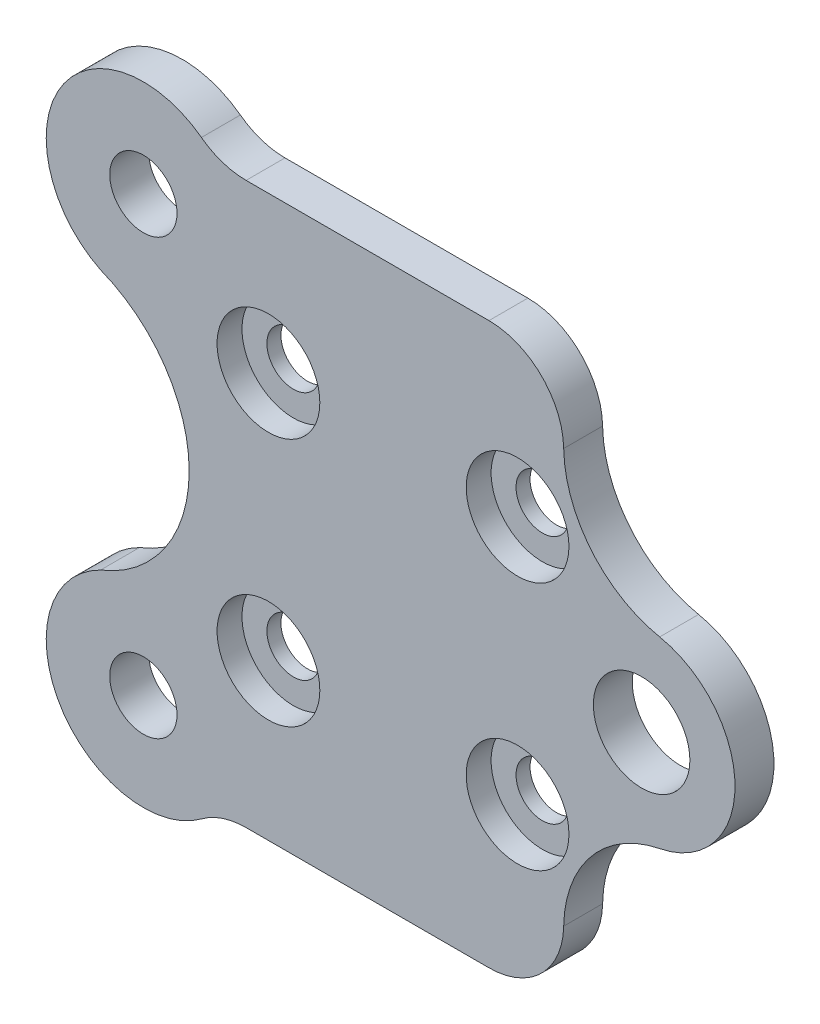
ISO-10303-21;
HEADER;
FILE_DESCRIPTION(('STEP AP214'),'2;1');
FILE_NAME('part.step','',(''),(''),'','','');
FILE_SCHEMA(('AUTOMOTIVE_DESIGN { 1 0 10303 214 1 1 1 1 }'));
ENDSEC;
DATA;
#1=APPLICATION_CONTEXT('core data for automotive mechanical design processes');
#2=APPLICATION_PROTOCOL_DEFINITION('international standard','automotive_design',2000,#1);
#3=PRODUCT_CONTEXT('',#1,'mechanical');
#4=PRODUCT('Part','Part','',(#3));
#5=PRODUCT_RELATED_PRODUCT_CATEGORY('part','',(#4));
#6=PRODUCT_DEFINITION_FORMATION('','',#4);
#7=PRODUCT_DEFINITION_CONTEXT('part definition',#1,'design');
#8=PRODUCT_DEFINITION('design','',#6,#7);
#9=PRODUCT_DEFINITION_SHAPE('','',#8);
#10=(LENGTH_UNIT() NAMED_UNIT(*) SI_UNIT(.MILLI.,.METRE.));
#11=(NAMED_UNIT(*) PLANE_ANGLE_UNIT() SI_UNIT($,.RADIAN.));
#12=(NAMED_UNIT(*) SI_UNIT($,.STERADIAN.) SOLID_ANGLE_UNIT());
#13=UNCERTAINTY_MEASURE_WITH_UNIT(LENGTH_MEASURE(1.E-05),#10,'distance_accuracy_value','');
#14=(GEOMETRIC_REPRESENTATION_CONTEXT(3) GLOBAL_UNCERTAINTY_ASSIGNED_CONTEXT((#13)) GLOBAL_UNIT_ASSIGNED_CONTEXT((#10,
#11,#12)) REPRESENTATION_CONTEXT('',''));
#15=CARTESIAN_POINT('',(0.,0.,0.));
#16=DIRECTION('',(0.,0.,1.));
#17=DIRECTION('',(1.,0.,0.));
#18=AXIS2_PLACEMENT_3D('',#15,#16,#17);
#19=CARTESIAN_POINT('',(82.0500548673,27.4305081809208,-3.125));
#20=DIRECTION('',(0.,0.,1.));
#21=DIRECTION('',(1.,0.,0.));
#22=AXIS2_PLACEMENT_3D('',#19,#20,#21);
#23=CYLINDRICAL_SURFACE('',#22,2.125);
#24=CARTESIAN_POINT('',(82.0500548673,27.4305081809208,-3.125));
#25=DIRECTION('',(0.,0.,1.));
#26=DIRECTION('',(1.,0.,0.));
#27=AXIS2_PLACEMENT_3D('',#24,#25,#26);
#28=CIRCLE('',#27,2.125);
#29=CARTESIAN_POINT('',(84.1750548673,27.4305081809208,-3.125));
#30=VERTEX_POINT('',#29);
#31=EDGE_CURVE('E501',#30,#30,#28,.T.);
#32=ORIENTED_EDGE('',*,*,#31,.F.);
#33=EDGE_LOOP('',(#32));
#34=FACE_BOUND('',#33,.T.);
#35=CARTESIAN_POINT('',(82.0500548673,27.4305081809208,-2.));
#36=DIRECTION('',(0.,0.,1.));
#37=DIRECTION('',(1.,0.,0.));
#38=AXIS2_PLACEMENT_3D('',#35,#36,#37);
#39=CIRCLE('',#38,2.125);
#40=CARTESIAN_POINT('',(84.1750548673,27.4305081809208,-2.));
#41=VERTEX_POINT('',#40);
#42=EDGE_CURVE('E414',#41,#41,#39,.F.);
#43=ORIENTED_EDGE('',*,*,#42,.F.);
#44=EDGE_LOOP('',(#43));
#45=FACE_BOUND('',#44,.T.);
#46=ADVANCED_FACE('F264',(#34,#45),#23,.F.);
#47=CARTESIAN_POINT('',(62.05010788,27.4305081809208,-3.125));
#48=DIRECTION('',(0.,0.,1.));
#49=DIRECTION('',(1.,0.,0.));
#50=AXIS2_PLACEMENT_3D('',#47,#48,#49);
#51=CYLINDRICAL_SURFACE('',#50,2.12500000000001);
#52=CARTESIAN_POINT('',(62.05010788,27.4305081809208,-3.125));
#53=DIRECTION('',(0.,0.,1.));
#54=DIRECTION('',(1.,0.,0.));
#55=AXIS2_PLACEMENT_3D('',#52,#53,#54);
#56=CIRCLE('',#55,2.12500000000001);
#57=CARTESIAN_POINT('',(64.17510788,27.4305081809208,-3.125));
#58=VERTEX_POINT('',#57);
#59=EDGE_CURVE('E496',#58,#58,#56,.T.);
#60=ORIENTED_EDGE('',*,*,#59,.F.);
#61=EDGE_LOOP('',(#60));
#62=FACE_BOUND('',#61,.T.);
#63=CARTESIAN_POINT('',(62.05010788,27.4305081809208,-2.));
#64=DIRECTION('',(0.,0.,1.));
#65=DIRECTION('',(1.,0.,0.));
#66=AXIS2_PLACEMENT_3D('',#63,#64,#65);
#67=CIRCLE('',#66,2.12500000000001);
#68=CARTESIAN_POINT('',(64.17510788,27.4305081809208,-2.));
#69=VERTEX_POINT('',#68);
#70=EDGE_CURVE('E529',#69,#69,#67,.T.);
#71=ORIENTED_EDGE('',*,*,#70,.T.);
#72=EDGE_LOOP('',(#71));
#73=FACE_BOUND('',#72,.T.);
#74=ADVANCED_FACE('F573',(#62,#73),#51,.F.);
#75=CARTESIAN_POINT('',(62.05010788,7.43050818092083,-3.125));
#76=DIRECTION('',(0.,0.,1.));
#77=DIRECTION('',(1.,0.,0.));
#78=AXIS2_PLACEMENT_3D('',#75,#76,#77);
#79=CYLINDRICAL_SURFACE('',#78,2.125);
#80=CARTESIAN_POINT('',(62.05010788,7.43050818092083,-3.125));
#81=DIRECTION('',(0.,0.,1.));
#82=DIRECTION('',(1.,0.,0.));
#83=AXIS2_PLACEMENT_3D('',#80,#81,#82);
#84=CIRCLE('',#83,2.125);
#85=CARTESIAN_POINT('',(64.17510788,7.43050818092083,-3.125));
#86=VERTEX_POINT('',#85);
#87=EDGE_CURVE('E507',#86,#86,#84,.T.);
#88=ORIENTED_EDGE('',*,*,#87,.F.);
#89=EDGE_LOOP('',(#88));
#90=FACE_BOUND('',#89,.T.);
#91=CARTESIAN_POINT('',(62.05010788,7.43050818092083,-2.));
#92=DIRECTION('',(0.,0.,1.));
#93=DIRECTION('',(1.,0.,0.));
#94=AXIS2_PLACEMENT_3D('',#91,#92,#93);
#95=CIRCLE('',#94,2.125);
#96=CARTESIAN_POINT('',(64.17510788,7.43050818092083,-2.));
#97=VERTEX_POINT('',#96);
#98=EDGE_CURVE('E520',#97,#97,#95,.T.);
#99=ORIENTED_EDGE('',*,*,#98,.T.);
#100=EDGE_LOOP('',(#99));
#101=FACE_BOUND('',#100,.T.);
#102=ADVANCED_FACE('F579',(#90,#101),#79,.F.);
#103=CARTESIAN_POINT('',(82.0500548673,7.43050818092083,-3.125));
#104=DIRECTION('',(0.,0.,1.));
#105=DIRECTION('',(1.,0.,0.));
#106=AXIS2_PLACEMENT_3D('',#103,#104,#105);
#107=CYLINDRICAL_SURFACE('',#106,2.125);
#108=CARTESIAN_POINT('',(82.0500548673,7.43050818092083,-3.125));
#109=DIRECTION('',(0.,0.,1.));
#110=DIRECTION('',(1.,0.,0.));
#111=AXIS2_PLACEMENT_3D('',#108,#109,#110);
#112=CIRCLE('',#111,2.125);
#113=CARTESIAN_POINT('',(84.1750548673,7.43050818092083,-3.125));
#114=VERTEX_POINT('',#113);
#115=EDGE_CURVE('E504',#114,#114,#112,.T.);
#116=ORIENTED_EDGE('',*,*,#115,.F.);
#117=EDGE_LOOP('',(#116));
#118=FACE_BOUND('',#117,.T.);
#119=CARTESIAN_POINT('',(82.0500548673,7.43050818092083,-2.));
#120=DIRECTION('',(0.,0.,1.));
#121=DIRECTION('',(1.,0.,0.));
#122=AXIS2_PLACEMENT_3D('',#119,#120,#121);
#123=CIRCLE('',#122,2.125);
#124=CARTESIAN_POINT('',(84.1750548673,7.43050818092083,-2.));
#125=VERTEX_POINT('',#124);
#126=EDGE_CURVE('E514',#125,#125,#123,.T.);
#127=ORIENTED_EDGE('',*,*,#126,.T.);
#128=EDGE_LOOP('',(#127));
#129=FACE_BOUND('',#128,.T.);
#130=ADVANCED_FACE('F585',(#118,#129),#107,.F.);
#131=CARTESIAN_POINT('',(52.0082075214231,-0.00478709079274138,-3.125));
#132=DIRECTION('',(0.,0.,1.));
#133=DIRECTION('',(1.,0.,0.));
#134=AXIS2_PLACEMENT_3D('',#131,#132,#133);
#135=CYLINDRICAL_SURFACE('',#134,7.80000000000975);
#136=CARTESIAN_POINT('',(52.0082075214231,-0.00478709079274138,-3.125));
#137=DIRECTION('',(0.,0.,1.));
#138=DIRECTION('',(1.,0.,0.));
#139=AXIS2_PLACEMENT_3D('',#136,#137,#138);
#140=CIRCLE('',#139,7.80000000000975);
#141=CARTESIAN_POINT('',(48.5735901579423,6.99831247772894,-3.125));
#142=VERTEX_POINT('',#141);
#143=CARTESIAN_POINT('',(56.6695313692701,-6.25875063287107,-3.125));
#144=VERTEX_POINT('',#143);
#145=EDGE_CURVE('E406',#142,#144,#140,.T.);
#146=ORIENTED_EDGE('',*,*,#145,.T.);
#147=DIRECTION('',(0.,0.,1.));
#148=VECTOR('',#147,1.);
#149=CARTESIAN_POINT('',(56.6695313692701,-6.25875063287107,-3.125));
#150=LINE('',#149,#148);
#151=CARTESIAN_POINT('',(56.6695313692701,-6.25875063287107,0.));
#152=VERTEX_POINT('',#151);
#153=EDGE_CURVE('E442',#144,#152,#150,.T.);
#154=ORIENTED_EDGE('',*,*,#153,.T.);
#155=CARTESIAN_POINT('',(52.0082075214231,-0.00478709079274138,0.));
#156=DIRECTION('',(0.,0.,1.));
#157=DIRECTION('',(1.,0.,0.));
#158=AXIS2_PLACEMENT_3D('',#155,#156,#157);
#159=CIRCLE('',#158,7.80000000000975);
#160=CARTESIAN_POINT('',(48.5735901579423,6.99831247772894,0.));
#161=VERTEX_POINT('',#160);
#162=EDGE_CURVE('E389',#161,#152,#159,.T.);
#163=ORIENTED_EDGE('',*,*,#162,.F.);
#164=DIRECTION('',(0.,0.,1.));
#165=VECTOR('',#164,1.);
#166=CARTESIAN_POINT('',(48.5735901579423,6.99831247772894,-3.125));
#167=LINE('',#166,#165);
#168=EDGE_CURVE('E407',#142,#161,#167,.T.);
#169=ORIENTED_EDGE('',*,*,#168,.F.);
#170=EDGE_LOOP('',(#146,#154,#163,#169));
#171=FACE_BOUND('',#170,.T.);
#172=ADVANCED_FACE('F474',(#171),#135,.T.);
#173=CARTESIAN_POINT('',(44.4800195239708,17.4305081809208,-3.125));
#174=DIRECTION('',(0.,0.,1.));
#175=DIRECTION('',(1.,0.,0.));
#176=AXIS2_PLACEMENT_3D('',#173,#174,#175);
#177=CYLINDRICAL_SURFACE('',#176,11.2066064321457);
#178=CARTESIAN_POINT('',(44.4800195239708,17.4305081809208,0.));
#179=DIRECTION('',(0.,0.,1.));
#180=DIRECTION('',(1.,0.,0.));
#181=AXIS2_PLACEMENT_3D('',#178,#179,#180);
#182=CIRCLE('',#181,11.2066064321457);
#183=CARTESIAN_POINT('',(48.5735901579423,27.8627038841127,0.));
#184=VERTEX_POINT('',#183);
#185=EDGE_CURVE('E404',#161,#184,#182,.T.);
#186=ORIENTED_EDGE('',*,*,#185,.T.);
#187=DIRECTION('',(0.,0.,1.));
#188=VECTOR('',#187,1.);
#189=CARTESIAN_POINT('',(48.5735901579423,27.8627038841127,-3.125));
#190=LINE('',#189,#188);
#191=CARTESIAN_POINT('',(48.5735901579423,27.8627038841127,-3.125));
#192=VERTEX_POINT('',#191);
#193=EDGE_CURVE('E410',#192,#184,#190,.T.);
#194=ORIENTED_EDGE('',*,*,#193,.F.);
#195=CARTESIAN_POINT('',(44.4800195239708,17.4305081809208,-3.125));
#196=DIRECTION('',(0.,0.,1.));
#197=DIRECTION('',(1.,0.,0.));
#198=AXIS2_PLACEMENT_3D('',#195,#196,#197);
#199=CIRCLE('',#198,11.2066064321457);
#200=EDGE_CURVE('E363',#142,#192,#199,.T.);
#201=ORIENTED_EDGE('',*,*,#200,.F.);
#202=ORIENTED_EDGE('',*,*,#168,.T.);
#203=EDGE_LOOP('',(#186,#194,#201,#202));
#204=FACE_BOUND('',#203,.T.);
#205=ADVANCED_FACE('F469',(#204),#177,.F.);
#206=CARTESIAN_POINT('',(52.0082075214231,34.8658034526344,-3.125));
#207=DIRECTION('',(0.,0.,1.));
#208=DIRECTION('',(1.,0.,0.));
#209=AXIS2_PLACEMENT_3D('',#206,#207,#208);
#210=CYLINDRICAL_SURFACE('',#209,7.80000000000975);
#211=CARTESIAN_POINT('',(52.0082075214231,34.8658034526344,0.));
#212=DIRECTION('',(0.,0.,-1.));
#213=DIRECTION('',(-1.,0.,0.));
#214=AXIS2_PLACEMENT_3D('',#211,#212,#213);
#215=CIRCLE('',#214,7.80000000000975);
#216=CARTESIAN_POINT('',(56.6695313692701,41.1197669947127,0.));
#217=VERTEX_POINT('',#216);
#218=EDGE_CURVE('E401',#184,#217,#215,.T.);
#219=ORIENTED_EDGE('',*,*,#218,.T.);
#220=DIRECTION('',(0.,0.,1.));
#221=VECTOR('',#220,1.);
#222=CARTESIAN_POINT('',(56.6695313692701,41.1197669947127,-3.125));
#223=LINE('',#222,#221);
#224=CARTESIAN_POINT('',(56.6695313692701,41.1197669947127,-3.125));
#225=VERTEX_POINT('',#224);
#226=EDGE_CURVE('E440',#217,#225,#223,.F.);
#227=ORIENTED_EDGE('',*,*,#226,.T.);
#228=CARTESIAN_POINT('',(52.0082075214231,34.8658034526344,-3.125));
#229=DIRECTION('',(0.,0.,-1.));
#230=DIRECTION('',(-1.,0.,0.));
#231=AXIS2_PLACEMENT_3D('',#228,#229,#230);
#232=CIRCLE('',#231,7.80000000000975);
#233=EDGE_CURVE('E385',#192,#225,#232,.T.);
#234=ORIENTED_EDGE('',*,*,#233,.F.);
#235=ORIENTED_EDGE('',*,*,#193,.T.);
#236=EDGE_LOOP('',(#219,#227,#234,#235));
#237=FACE_BOUND('',#236,.T.);
#238=ADVANCED_FACE('F465',(#237),#210,.T.);
#239=CARTESIAN_POINT('',(57.940219491693,39.9305081809208,-3.125));
#240=DIRECTION('',(0.,-1.,0.));
#241=DIRECTION('',(0.,0.,-1.));
#242=AXIS2_PLACEMENT_3D('',#239,#240,#241);
#243=PLANE('',#242);
#244=DIRECTION('',(1.,0.,0.));
#245=VECTOR('',#244,1.);
#246=CARTESIAN_POINT('',(57.940219491693,39.9305081809208,-3.125));
#247=LINE('',#246,#245);
#248=CARTESIAN_POINT('',(60.2551650983787,39.9305081809208,-3.125));
#249=VERTEX_POINT('',#248);
#250=CARTESIAN_POINT('',(79.7529034768474,39.9305081809208,-3.125));
#251=VERTEX_POINT('',#250);
#252=EDGE_CURVE('E380',#249,#251,#247,.T.);
#253=ORIENTED_EDGE('',*,*,#252,.F.);
#254=DIRECTION('',(0.,0.,-1.));
#255=VECTOR('',#254,1.);
#256=CARTESIAN_POINT('',(60.2551650983787,39.9305081809208,0.));
#257=LINE('',#256,#255);
#258=CARTESIAN_POINT('',(60.2551650983787,39.9305081809208,0.));
#259=VERTEX_POINT('',#258);
#260=EDGE_CURVE('E437',#249,#259,#257,.F.);
#261=ORIENTED_EDGE('',*,*,#260,.T.);
#262=DIRECTION('',(1.,0.,0.));
#263=VECTOR('',#262,1.);
#264=CARTESIAN_POINT('',(57.940219491693,39.9305081809208,0.));
#265=LINE('',#264,#263);
#266=CARTESIAN_POINT('',(79.7529034768474,39.9305081809208,0.));
#267=VERTEX_POINT('',#266);
#268=EDGE_CURVE('E399',#259,#267,#265,.T.);
#269=ORIENTED_EDGE('',*,*,#268,.T.);
#270=DIRECTION('',(0.,0.,1.));
#271=VECTOR('',#270,1.);
#272=CARTESIAN_POINT('',(79.7529034768474,39.9305081809208,-3.125));
#273=LINE('',#272,#271);
#274=EDGE_CURVE('E434',#267,#251,#273,.F.);
#275=ORIENTED_EDGE('',*,*,#274,.T.);
#276=EDGE_LOOP('',(#253,#261,#269,#275));
#277=FACE_BOUND('',#276,.T.);
#278=ADVANCED_FACE('F456',(#277),#243,.F.);
#279=CARTESIAN_POINT('',(95.3555620860846,34.2048076301968,-3.125));
#280=DIRECTION('',(0.,0.,1.));
#281=DIRECTION('',(1.,0.,0.));
#282=AXIS2_PLACEMENT_3D('',#279,#280,#281);
#283=CYLINDRICAL_SURFACE('',#282,9.60506955653446);
#284=CARTESIAN_POINT('',(95.3555620860846,34.2048076301968,-3.125));
#285=DIRECTION('',(0.,0.,1.));
#286=DIRECTION('',(1.,0.,0.));
#287=AXIS2_PLACEMENT_3D('',#284,#285,#286);
#288=CIRCLE('',#287,9.60506955653446);
#289=CARTESIAN_POINT('',(85.7519764906695,34.0359736958097,-3.125));
#290=VERTEX_POINT('',#289);
#291=CARTESIAN_POINT('',(93.4574363423077,24.7891568376772,-3.125));
#292=VERTEX_POINT('',#291);
#293=EDGE_CURVE('E377',#290,#292,#288,.T.);
#294=ORIENTED_EDGE('',*,*,#293,.F.);
#295=DIRECTION('',(0.,0.,1.));
#296=VECTOR('',#295,1.);
#297=CARTESIAN_POINT('',(85.7519764906695,34.0359736958097,-3.125));
#298=LINE('',#297,#296);
#299=CARTESIAN_POINT('',(85.7519764906695,34.0359736958097,0.));
#300=VERTEX_POINT('',#299);
#301=EDGE_CURVE('E431',#290,#300,#298,.T.);
#302=ORIENTED_EDGE('',*,*,#301,.T.);
#303=CARTESIAN_POINT('',(95.3555620860846,34.2048076301968,0.));
#304=DIRECTION('',(0.,0.,1.));
#305=DIRECTION('',(1.,0.,0.));
#306=AXIS2_PLACEMENT_3D('',#303,#304,#305);
#307=CIRCLE('',#306,9.60506955653446);
#308=CARTESIAN_POINT('',(93.4574363423077,24.7891568376772,0.));
#309=VERTEX_POINT('',#308);
#310=EDGE_CURVE('E397',#300,#309,#307,.T.);
#311=ORIENTED_EDGE('',*,*,#310,.T.);
#312=DIRECTION('',(0.,0.,1.));
#313=VECTOR('',#312,1.);
#314=CARTESIAN_POINT('',(93.4574363423077,24.7891568376772,-3.125));
#315=LINE('',#314,#313);
#316=EDGE_CURVE('E362',#292,#309,#315,.T.);
#317=ORIENTED_EDGE('',*,*,#316,.F.);
#318=EDGE_LOOP('',(#294,#302,#311,#317));
#319=FACE_BOUND('',#318,.T.);
#320=ADVANCED_FACE('F619',(#319),#283,.F.);
#321=CARTESIAN_POINT('',(92.0081986301231,17.4305081809208,-3.125));
#322=DIRECTION('',(0.,0.,1.));
#323=DIRECTION('',(1.,0.,0.));
#324=AXIS2_PLACEMENT_3D('',#321,#322,#323);
#325=CYLINDRICAL_SURFACE('',#324,7.49999999999999);
#326=CARTESIAN_POINT('',(92.0081986301231,17.4305081809208,0.));
#327=DIRECTION('',(0.,0.,1.));
#328=DIRECTION('',(1.,0.,0.));
#329=AXIS2_PLACEMENT_3D('',#326,#327,#328);
#330=CIRCLE('',#329,7.49999999999999);
#331=CARTESIAN_POINT('',(93.4574363423077,10.0718595241645,0.));
#332=VERTEX_POINT('',#331);
#333=EDGE_CURVE('E358',#332,#309,#330,.T.);
#334=ORIENTED_EDGE('',*,*,#333,.F.);
#335=DIRECTION('',(0.,0.,1.));
#336=VECTOR('',#335,1.);
#337=CARTESIAN_POINT('',(93.4574363423077,10.0718595241645,-3.125));
#338=LINE('',#337,#336);
#339=CARTESIAN_POINT('',(93.4574363423077,10.0718595241645,-3.125));
#340=VERTEX_POINT('',#339);
#341=EDGE_CURVE('E351',#340,#332,#338,.T.);
#342=ORIENTED_EDGE('',*,*,#341,.F.);
#343=CARTESIAN_POINT('',(92.0081986301231,17.4305081809208,-3.125));
#344=DIRECTION('',(0.,0.,1.));
#345=DIRECTION('',(1.,0.,0.));
#346=AXIS2_PLACEMENT_3D('',#343,#344,#345);
#347=CIRCLE('',#346,7.49999999999999);
#348=EDGE_CURVE('E356',#340,#292,#347,.T.);
#349=ORIENTED_EDGE('',*,*,#348,.T.);
#350=ORIENTED_EDGE('',*,*,#316,.T.);
#351=EDGE_LOOP('',(#334,#342,#349,#350));
#352=FACE_BOUND('',#351,.T.);
#353=ADVANCED_FACE('F353',(#352),#325,.T.);
#354=CARTESIAN_POINT('',(95.3555620860846,0.656208731644823,-3.125));
#355=DIRECTION('',(0.,0.,1.));
#356=DIRECTION('',(1.,0.,0.));
#357=AXIS2_PLACEMENT_3D('',#354,#355,#356);
#358=CYLINDRICAL_SURFACE('',#357,9.60506955653445);
#359=CARTESIAN_POINT('',(95.3555620860846,0.656208731644823,0.));
#360=DIRECTION('',(0.,0.,1.));
#361=DIRECTION('',(1.,0.,0.));
#362=AXIS2_PLACEMENT_3D('',#359,#360,#361);
#363=CIRCLE('',#362,9.60506955653445);
#364=CARTESIAN_POINT('',(85.7519764906695,0.825042666032002,0.));
#365=VERTEX_POINT('',#364);
#366=EDGE_CURVE('E394',#332,#365,#363,.T.);
#367=ORIENTED_EDGE('',*,*,#366,.T.);
#368=DIRECTION('',(0.,0.,1.));
#369=VECTOR('',#368,1.);
#370=CARTESIAN_POINT('',(85.7519764906695,0.825042666032002,-3.125));
#371=LINE('',#370,#369);
#372=CARTESIAN_POINT('',(85.7519764906695,0.825042666032002,-3.125));
#373=VERTEX_POINT('',#372);
#374=EDGE_CURVE('E369',#365,#373,#371,.F.);
#375=ORIENTED_EDGE('',*,*,#374,.T.);
#376=CARTESIAN_POINT('',(95.3555620860846,0.656208731644823,-3.125));
#377=DIRECTION('',(0.,0.,1.));
#378=DIRECTION('',(1.,0.,0.));
#379=AXIS2_PLACEMENT_3D('',#376,#377,#378);
#380=CIRCLE('',#379,9.60506955653445);
#381=EDGE_CURVE('E366',#340,#373,#380,.T.);
#382=ORIENTED_EDGE('',*,*,#381,.F.);
#383=ORIENTED_EDGE('',*,*,#341,.T.);
#384=EDGE_LOOP('',(#367,#375,#382,#383));
#385=FACE_BOUND('',#384,.T.);
#386=ADVANCED_FACE('F367',(#385),#358,.F.);
#387=CARTESIAN_POINT('',(57.940219491693,-5.06949181907916,-3.125));
#388=DIRECTION('',(0.,-1.,0.));
#389=DIRECTION('',(1.,0.,0.));
#390=AXIS2_PLACEMENT_3D('',#387,#388,#389);
#391=PLANE('',#390);
#392=DIRECTION('',(1.,0.,0.));
#393=VECTOR('',#392,1.);
#394=CARTESIAN_POINT('',(57.940219491693,-5.06949181907916,0.));
#395=LINE('',#394,#393);
#396=CARTESIAN_POINT('',(60.2551650983787,-5.06949181907916,0.));
#397=VERTEX_POINT('',#396);
#398=CARTESIAN_POINT('',(79.7529034768474,-5.06949181907915,0.));
#399=VERTEX_POINT('',#398);
#400=EDGE_CURVE('E391',#397,#399,#395,.T.);
#401=ORIENTED_EDGE('',*,*,#400,.F.);
#402=DIRECTION('',(0.,0.,-1.));
#403=VECTOR('',#402,1.);
#404=CARTESIAN_POINT('',(60.2551650983787,-5.06949181907916,-3.125));
#405=LINE('',#404,#403);
#406=CARTESIAN_POINT('',(60.2551650983787,-5.06949181907916,-3.125));
#407=VERTEX_POINT('',#406);
#408=EDGE_CURVE('E285',#397,#407,#405,.T.);
#409=ORIENTED_EDGE('',*,*,#408,.T.);
#410=DIRECTION('',(1.,0.,0.));
#411=VECTOR('',#410,1.);
#412=CARTESIAN_POINT('',(57.940219491693,-5.06949181907916,-3.125));
#413=LINE('',#412,#411);
#414=CARTESIAN_POINT('',(79.7529034768474,-5.06949181907915,-3.125));
#415=VERTEX_POINT('',#414);
#416=EDGE_CURVE('E373',#407,#415,#413,.T.);
#417=ORIENTED_EDGE('',*,*,#416,.T.);
#418=DIRECTION('',(0.,0.,-1.));
#419=VECTOR('',#418,1.);
#420=CARTESIAN_POINT('',(79.7529034768474,-5.06949181907915,0.));
#421=LINE('',#420,#419);
#422=EDGE_CURVE('E409',#415,#399,#421,.F.);
#423=ORIENTED_EDGE('',*,*,#422,.T.);
#424=EDGE_LOOP('',(#401,#409,#417,#423));
#425=FACE_BOUND('',#424,.T.);
#426=ADVANCED_FACE('F602',(#425),#391,.T.);
#427=CARTESIAN_POINT('',(52.0082075214231,-0.00478709079274138,-3.125));
#428=DIRECTION('',(0.,0.,1.));
#429=DIRECTION('',(1.,0.,0.));
#430=AXIS2_PLACEMENT_3D('',#427,#428,#429);
#431=PLANE('',#430);
#432=ORIENTED_EDGE('',*,*,#87,.T.);
#433=EDGE_LOOP('',(#432));
#434=FACE_BOUND('',#433,.T.);
#435=ORIENTED_EDGE('',*,*,#115,.T.);
#436=EDGE_LOOP('',(#435));
#437=FACE_BOUND('',#436,.T.);
#438=ORIENTED_EDGE('',*,*,#31,.T.);
#439=EDGE_LOOP('',(#438));
#440=FACE_BOUND('',#439,.T.);
#441=ORIENTED_EDGE('',*,*,#59,.T.);
#442=EDGE_LOOP('',(#441));
#443=FACE_BOUND('',#442,.T.);
#444=CARTESIAN_POINT('',(92.0081986301231,17.4305081809208,-3.125));
#445=DIRECTION('',(0.,0.,1.));
#446=DIRECTION('',(1.,0.,0.));
#447=AXIS2_PLACEMENT_3D('',#444,#445,#446);
#448=CIRCLE('',#447,3.875);
#449=CARTESIAN_POINT('',(95.8831986301231,17.4305081809208,-3.125));
#450=VERTEX_POINT('',#449);
#451=EDGE_CURVE('E490',#450,#450,#448,.T.);
#452=ORIENTED_EDGE('',*,*,#451,.T.);
#453=EDGE_LOOP('',(#452));
#454=FACE_BOUND('',#453,.T.);
#455=CARTESIAN_POINT('',(52.0082075214231,-0.00478709079274138,-3.125));
#456=DIRECTION('',(0.,0.,1.));
#457=DIRECTION('',(1.,0.,0.));
#458=AXIS2_PLACEMENT_3D('',#455,#456,#457);
#459=CIRCLE('',#458,2.7);
#460=CARTESIAN_POINT('',(54.7082075214231,-0.00478709079274138,-3.125));
#461=VERTEX_POINT('',#460);
#462=EDGE_CURVE('E484',#461,#461,#459,.T.);
#463=ORIENTED_EDGE('',*,*,#462,.T.);
#464=EDGE_LOOP('',(#463));
#465=FACE_BOUND('',#464,.T.);
#466=CARTESIAN_POINT('',(52.0082075214231,34.8658034526344,-3.125));
#467=DIRECTION('',(0.,0.,1.));
#468=DIRECTION('',(1.,0.,0.));
#469=AXIS2_PLACEMENT_3D('',#466,#467,#468);
#470=CIRCLE('',#469,2.70000000000001);
#471=CARTESIAN_POINT('',(54.7082075214231,34.8658034526344,-3.125));
#472=VERTEX_POINT('',#471);
#473=EDGE_CURVE('E392',#472,#472,#470,.T.);
#474=ORIENTED_EDGE('',*,*,#473,.T.);
#475=EDGE_LOOP('',(#474));
#476=FACE_BOUND('',#475,.T.);
#477=ORIENTED_EDGE('',*,*,#381,.T.);
#478=CARTESIAN_POINT('',(79.7529034768474,0.930508180920847,-3.125));
#479=DIRECTION('',(0.,0.,1.));
#480=DIRECTION('',(1.,0.,0.));
#481=AXIS2_PLACEMENT_3D('',#478,#479,#480);
#482=CIRCLE('',#481,6.);
#483=EDGE_CURVE('E429',#373,#415,#482,.F.);
#484=ORIENTED_EDGE('',*,*,#483,.T.);
#485=ORIENTED_EDGE('',*,*,#416,.F.);
#486=CARTESIAN_POINT('',(60.2551650983787,-11.0694918190792,-3.125));
#487=DIRECTION('',(0.,0.,1.));
#488=DIRECTION('',(1.,0.,0.));
#489=AXIS2_PLACEMENT_3D('',#486,#487,#488);
#490=CIRCLE('',#489,6.);
#491=EDGE_CURVE('E12',#407,#144,#490,.T.);
#492=ORIENTED_EDGE('',*,*,#491,.T.);
#493=ORIENTED_EDGE('',*,*,#145,.F.);
#494=ORIENTED_EDGE('',*,*,#200,.T.);
#495=ORIENTED_EDGE('',*,*,#233,.T.);
#496=CARTESIAN_POINT('',(60.2551650983787,45.9305081809208,-3.125));
#497=DIRECTION('',(0.,0.,1.));
#498=DIRECTION('',(1.,0.,0.));
#499=AXIS2_PLACEMENT_3D('',#496,#497,#498);
#500=CIRCLE('',#499,6.);
#501=EDGE_CURVE('E448',#225,#249,#500,.T.);
#502=ORIENTED_EDGE('',*,*,#501,.T.);
#503=ORIENTED_EDGE('',*,*,#252,.T.);
#504=CARTESIAN_POINT('',(79.7529034768474,33.9305081809208,-3.125));
#505=DIRECTION('',(0.,0.,1.));
#506=DIRECTION('',(1.,0.,0.));
#507=AXIS2_PLACEMENT_3D('',#504,#505,#506);
#508=CIRCLE('',#507,6.);
#509=EDGE_CURVE('E427',#251,#290,#508,.F.);
#510=ORIENTED_EDGE('',*,*,#509,.T.);
#511=ORIENTED_EDGE('',*,*,#293,.T.);
#512=ORIENTED_EDGE('',*,*,#348,.F.);
#513=EDGE_LOOP('',(#477,#484,#485,#492,#493,#494,#495,#502,#503,#510,#511,#512));
#514=FACE_BOUND('',#513,.T.);
#515=ADVANCED_FACE('F375',(#434,#437,#440,#443,#454,#465,#476,#514),#431,.F.);
#516=CARTESIAN_POINT('',(52.0082075214231,-0.00478709079274138,0.));
#517=DIRECTION('',(0.,0.,1.));
#518=DIRECTION('',(1.,0.,0.));
#519=AXIS2_PLACEMENT_3D('',#516,#517,#518);
#520=PLANE('',#519);
#521=CARTESIAN_POINT('',(82.0500548673,27.4305081809208,0.));
#522=DIRECTION('',(0.,0.,1.));
#523=DIRECTION('',(1.,0.,0.));
#524=AXIS2_PLACEMENT_3D('',#521,#522,#523);
#525=CIRCLE('',#524,4.125);
#526=CARTESIAN_POINT('',(86.1750548673,27.4305081809208,0.));
#527=VERTEX_POINT('',#526);
#528=EDGE_CURVE('E418',#527,#527,#525,.T.);
#529=ORIENTED_EDGE('',*,*,#528,.F.);
#530=EDGE_LOOP('',(#529));
#531=FACE_BOUND('',#530,.T.);
#532=CARTESIAN_POINT('',(62.05010788,27.4305081809208,0.));
#533=DIRECTION('',(0.,0.,1.));
#534=DIRECTION('',(1.,0.,0.));
#535=AXIS2_PLACEMENT_3D('',#532,#533,#534);
#536=CIRCLE('',#535,4.12500000000001);
#537=CARTESIAN_POINT('',(66.17510788,27.4305081809208,0.));
#538=VERTEX_POINT('',#537);
#539=EDGE_CURVE('E526',#538,#538,#536,.T.);
#540=ORIENTED_EDGE('',*,*,#539,.F.);
#541=EDGE_LOOP('',(#540));
#542=FACE_BOUND('',#541,.T.);
#543=CARTESIAN_POINT('',(62.05010788,7.43050818092083,0.));
#544=DIRECTION('',(0.,0.,1.));
#545=DIRECTION('',(1.,0.,0.));
#546=AXIS2_PLACEMENT_3D('',#543,#544,#545);
#547=CIRCLE('',#546,4.12499999999999);
#548=CARTESIAN_POINT('',(66.17510788,7.43050818092083,0.));
#549=VERTEX_POINT('',#548);
#550=EDGE_CURVE('E515',#549,#549,#547,.T.);
#551=ORIENTED_EDGE('',*,*,#550,.F.);
#552=EDGE_LOOP('',(#551));
#553=FACE_BOUND('',#552,.T.);
#554=CARTESIAN_POINT('',(82.0500548673,7.43050818092083,0.));
#555=DIRECTION('',(0.,0.,1.));
#556=DIRECTION('',(1.,0.,0.));
#557=AXIS2_PLACEMENT_3D('',#554,#555,#556);
#558=CIRCLE('',#557,4.125);
#559=CARTESIAN_POINT('',(86.1750548673,7.43050818092083,0.));
#560=VERTEX_POINT('',#559);
#561=EDGE_CURVE('E511',#560,#560,#558,.T.);
#562=ORIENTED_EDGE('',*,*,#561,.F.);
#563=EDGE_LOOP('',(#562));
#564=FACE_BOUND('',#563,.T.);
#565=CARTESIAN_POINT('',(92.0081986301231,17.4305081809208,0.));
#566=DIRECTION('',(0.,0.,1.));
#567=DIRECTION('',(1.,0.,0.));
#568=AXIS2_PLACEMENT_3D('',#565,#566,#567);
#569=CIRCLE('',#568,3.875);
#570=CARTESIAN_POINT('',(95.8831986301231,17.4305081809208,0.));
#571=VERTEX_POINT('',#570);
#572=EDGE_CURVE('E493',#571,#571,#569,.T.);
#573=ORIENTED_EDGE('',*,*,#572,.F.);
#574=EDGE_LOOP('',(#573));
#575=FACE_BOUND('',#574,.T.);
#576=CARTESIAN_POINT('',(52.0082075214231,-0.00478709079274138,0.));
#577=DIRECTION('',(0.,0.,1.));
#578=DIRECTION('',(1.,0.,0.));
#579=AXIS2_PLACEMENT_3D('',#576,#577,#578);
#580=CIRCLE('',#579,2.7);
#581=CARTESIAN_POINT('',(54.7082075214231,-0.00478709079274138,0.));
#582=VERTEX_POINT('',#581);
#583=EDGE_CURVE('E487',#582,#582,#580,.T.);
#584=ORIENTED_EDGE('',*,*,#583,.F.);
#585=EDGE_LOOP('',(#584));
#586=FACE_BOUND('',#585,.T.);
#587=CARTESIAN_POINT('',(52.0082075214231,34.8658034526344,0.));
#588=DIRECTION('',(0.,0.,1.));
#589=DIRECTION('',(1.,0.,0.));
#590=AXIS2_PLACEMENT_3D('',#587,#588,#589);
#591=CIRCLE('',#590,2.70000000000001);
#592=CARTESIAN_POINT('',(54.7082075214231,34.8658034526344,0.));
#593=VERTEX_POINT('',#592);
#594=EDGE_CURVE('E481',#593,#593,#591,.T.);
#595=ORIENTED_EDGE('',*,*,#594,.F.);
#596=EDGE_LOOP('',(#595));
#597=FACE_BOUND('',#596,.T.);
#598=ORIENTED_EDGE('',*,*,#162,.T.);
#599=CARTESIAN_POINT('',(60.2551650983787,-11.0694918190792,0.));
#600=DIRECTION('',(0.,0.,1.));
#601=DIRECTION('',(1.,0.,0.));
#602=AXIS2_PLACEMENT_3D('',#599,#600,#601);
#603=CIRCLE('',#602,6.);
#604=EDGE_CURVE('E272',#152,#397,#603,.F.);
#605=ORIENTED_EDGE('',*,*,#604,.T.);
#606=ORIENTED_EDGE('',*,*,#400,.T.);
#607=CARTESIAN_POINT('',(79.7529034768474,0.930508180920847,0.));
#608=DIRECTION('',(0.,0.,1.));
#609=DIRECTION('',(1.,0.,0.));
#610=AXIS2_PLACEMENT_3D('',#607,#608,#609);
#611=CIRCLE('',#610,6.);
#612=EDGE_CURVE('E424',#399,#365,#611,.T.);
#613=ORIENTED_EDGE('',*,*,#612,.T.);
#614=ORIENTED_EDGE('',*,*,#366,.F.);
#615=ORIENTED_EDGE('',*,*,#333,.T.);
#616=ORIENTED_EDGE('',*,*,#310,.F.);
#617=CARTESIAN_POINT('',(79.7529034768474,33.9305081809208,0.));
#618=DIRECTION('',(0.,0.,1.));
#619=DIRECTION('',(1.,0.,0.));
#620=AXIS2_PLACEMENT_3D('',#617,#618,#619);
#621=CIRCLE('',#620,6.);
#622=EDGE_CURVE('E421',#300,#267,#621,.T.);
#623=ORIENTED_EDGE('',*,*,#622,.T.);
#624=ORIENTED_EDGE('',*,*,#268,.F.);
#625=CARTESIAN_POINT('',(60.2551650983787,45.9305081809208,0.));
#626=DIRECTION('',(0.,0.,1.));
#627=DIRECTION('',(1.,0.,0.));
#628=AXIS2_PLACEMENT_3D('',#625,#626,#627);
#629=CIRCLE('',#628,6.);
#630=EDGE_CURVE('E446',#259,#217,#629,.F.);
#631=ORIENTED_EDGE('',*,*,#630,.T.);
#632=ORIENTED_EDGE('',*,*,#218,.F.);
#633=ORIENTED_EDGE('',*,*,#185,.F.);
#634=EDGE_LOOP('',(#598,#605,#606,#613,#614,#615,#616,#623,#624,#631,#632,#633));
#635=FACE_BOUND('',#634,.T.);
#636=ADVANCED_FACE('F462',(#531,#542,#553,#564,#575,#586,#597,#635),#520,.T.);
#637=CARTESIAN_POINT('',(52.0082075214231,34.8658034526344,-3.125));
#638=DIRECTION('',(0.,0.,1.));
#639=DIRECTION('',(1.,0.,0.));
#640=AXIS2_PLACEMENT_3D('',#637,#638,#639);
#641=CYLINDRICAL_SURFACE('',#640,2.70000000000001);
#642=ORIENTED_EDGE('',*,*,#473,.F.);
#643=EDGE_LOOP('',(#642));
#644=FACE_BOUND('',#643,.T.);
#645=ORIENTED_EDGE('',*,*,#594,.T.);
#646=EDGE_LOOP('',(#645));
#647=FACE_BOUND('',#646,.T.);
#648=ADVANCED_FACE('F546',(#644,#647),#641,.F.);
#649=CARTESIAN_POINT('',(52.0082075214231,-0.00478709079274138,-3.125));
#650=DIRECTION('',(0.,0.,1.));
#651=DIRECTION('',(1.,0.,0.));
#652=AXIS2_PLACEMENT_3D('',#649,#650,#651);
#653=CYLINDRICAL_SURFACE('',#652,2.7);
#654=ORIENTED_EDGE('',*,*,#462,.F.);
#655=EDGE_LOOP('',(#654));
#656=FACE_BOUND('',#655,.T.);
#657=ORIENTED_EDGE('',*,*,#583,.T.);
#658=EDGE_LOOP('',(#657));
#659=FACE_BOUND('',#658,.T.);
#660=ADVANCED_FACE('F561',(#656,#659),#653,.F.);
#661=CARTESIAN_POINT('',(92.0081986301231,17.4305081809208,-3.125));
#662=DIRECTION('',(0.,0.,1.));
#663=DIRECTION('',(1.,0.,0.));
#664=AXIS2_PLACEMENT_3D('',#661,#662,#663);
#665=CYLINDRICAL_SURFACE('',#664,3.875);
#666=ORIENTED_EDGE('',*,*,#451,.F.);
#667=EDGE_LOOP('',(#666));
#668=FACE_BOUND('',#667,.T.);
#669=ORIENTED_EDGE('',*,*,#572,.T.);
#670=EDGE_LOOP('',(#669));
#671=FACE_BOUND('',#670,.T.);
#672=ADVANCED_FACE('F567',(#668,#671),#665,.F.);
#673=CARTESIAN_POINT('',(82.0500548673,7.43050818092083,-2.));
#674=DIRECTION('',(0.,0.,1.));
#675=DIRECTION('',(1.,0.,0.));
#676=AXIS2_PLACEMENT_3D('',#673,#674,#675);
#677=CYLINDRICAL_SURFACE('',#676,4.125);
#678=CARTESIAN_POINT('',(82.0500548673,7.43050818092083,-2.));
#679=DIRECTION('',(0.,0.,1.));
#680=DIRECTION('',(1.,0.,0.));
#681=AXIS2_PLACEMENT_3D('',#678,#679,#680);
#682=CIRCLE('',#681,4.125);
#683=CARTESIAN_POINT('',(86.1750548673,7.43050818092083,-2.));
#684=VERTEX_POINT('',#683);
#685=EDGE_CURVE('E510',#684,#684,#682,.T.);
#686=ORIENTED_EDGE('',*,*,#685,.F.);
#687=EDGE_LOOP('',(#686));
#688=FACE_BOUND('',#687,.T.);
#689=ORIENTED_EDGE('',*,*,#561,.T.);
#690=EDGE_LOOP('',(#689));
#691=FACE_BOUND('',#690,.T.);
#692=ADVANCED_FACE('F589',(#688,#691),#677,.F.);
#693=CARTESIAN_POINT('',(0.,0.,-2.));
#694=DIRECTION('',(0.,0.,1.));
#695=DIRECTION('',(1.,0.,0.));
#696=AXIS2_PLACEMENT_3D('',#693,#694,#695);
#697=PLANE('',#696);
#698=ORIENTED_EDGE('',*,*,#126,.F.);
#699=EDGE_LOOP('',(#698));
#700=FACE_BOUND('',#699,.T.);
#701=ORIENTED_EDGE('',*,*,#685,.T.);
#702=EDGE_LOOP('',(#701));
#703=FACE_BOUND('',#702,.T.);
#704=ADVANCED_FACE('F594',(#700,#703),#697,.T.);
#705=CARTESIAN_POINT('',(62.05010788,7.43050818092083,-2.));
#706=DIRECTION('',(0.,0.,1.));
#707=DIRECTION('',(1.,0.,0.));
#708=AXIS2_PLACEMENT_3D('',#705,#706,#707);
#709=CYLINDRICAL_SURFACE('',#708,4.12499999999999);
#710=CARTESIAN_POINT('',(62.05010788,7.43050818092083,-2.));
#711=DIRECTION('',(0.,0.,1.));
#712=DIRECTION('',(1.,0.,0.));
#713=AXIS2_PLACEMENT_3D('',#710,#711,#712);
#714=CIRCLE('',#713,4.12499999999999);
#715=CARTESIAN_POINT('',(66.17510788,7.43050818092083,-2.));
#716=VERTEX_POINT('',#715);
#717=EDGE_CURVE('E523',#716,#716,#714,.T.);
#718=ORIENTED_EDGE('',*,*,#717,.F.);
#719=EDGE_LOOP('',(#718));
#720=FACE_BOUND('',#719,.T.);
#721=ORIENTED_EDGE('',*,*,#550,.T.);
#722=EDGE_LOOP('',(#721));
#723=FACE_BOUND('',#722,.T.);
#724=ADVANCED_FACE('F761',(#720,#723),#709,.F.);
#725=CARTESIAN_POINT('',(0.,0.,-2.));
#726=DIRECTION('',(0.,0.,1.));
#727=DIRECTION('',(1.,0.,0.));
#728=AXIS2_PLACEMENT_3D('',#725,#726,#727);
#729=PLANE('',#728);
#730=ORIENTED_EDGE('',*,*,#98,.F.);
#731=EDGE_LOOP('',(#730));
#732=FACE_BOUND('',#731,.T.);
#733=ORIENTED_EDGE('',*,*,#717,.T.);
#734=EDGE_LOOP('',(#733));
#735=FACE_BOUND('',#734,.T.);
#736=ADVANCED_FACE('F751',(#732,#735),#729,.T.);
#737=CARTESIAN_POINT('',(62.05010788,27.4305081809208,-2.));
#738=DIRECTION('',(0.,0.,1.));
#739=DIRECTION('',(1.,0.,0.));
#740=AXIS2_PLACEMENT_3D('',#737,#738,#739);
#741=CYLINDRICAL_SURFACE('',#740,4.12500000000001);
#742=CARTESIAN_POINT('',(62.05010788,27.4305081809208,-2.));
#743=DIRECTION('',(0.,0.,1.));
#744=DIRECTION('',(1.,0.,0.));
#745=AXIS2_PLACEMENT_3D('',#742,#743,#744);
#746=CIRCLE('',#745,4.12500000000001);
#747=CARTESIAN_POINT('',(66.17510788,27.4305081809208,-2.));
#748=VERTEX_POINT('',#747);
#749=EDGE_CURVE('E417',#748,#748,#746,.T.);
#750=ORIENTED_EDGE('',*,*,#749,.F.);
#751=EDGE_LOOP('',(#750));
#752=FACE_BOUND('',#751,.T.);
#753=ORIENTED_EDGE('',*,*,#539,.T.);
#754=EDGE_LOOP('',(#753));
#755=FACE_BOUND('',#754,.T.);
#756=ADVANCED_FACE('F741',(#752,#755),#741,.F.);
#757=CARTESIAN_POINT('',(0.,0.,-2.));
#758=DIRECTION('',(0.,0.,1.));
#759=DIRECTION('',(1.,0.,0.));
#760=AXIS2_PLACEMENT_3D('',#757,#758,#759);
#761=PLANE('',#760);
#762=ORIENTED_EDGE('',*,*,#70,.F.);
#763=EDGE_LOOP('',(#762));
#764=FACE_BOUND('',#763,.T.);
#765=ORIENTED_EDGE('',*,*,#749,.T.);
#766=EDGE_LOOP('',(#765));
#767=FACE_BOUND('',#766,.T.);
#768=ADVANCED_FACE('F731',(#764,#767),#761,.T.);
#769=CARTESIAN_POINT('',(82.0500548673,27.4305081809208,-2.));
#770=DIRECTION('',(0.,0.,1.));
#771=DIRECTION('',(1.,0.,0.));
#772=AXIS2_PLACEMENT_3D('',#769,#770,#771);
#773=PLANE('',#772);
#774=CARTESIAN_POINT('',(82.0500548673,27.4305081809208,-2.));
#775=DIRECTION('',(0.,0.,1.));
#776=DIRECTION('',(1.,0.,0.));
#777=AXIS2_PLACEMENT_3D('',#774,#775,#776);
#778=CIRCLE('',#777,4.125);
#779=CARTESIAN_POINT('',(86.1750548673,27.4305081809208,-2.));
#780=VERTEX_POINT('',#779);
#781=EDGE_CURVE('E536',#780,#780,#778,.T.);
#782=ORIENTED_EDGE('',*,*,#781,.T.);
#783=EDGE_LOOP('',(#782));
#784=FACE_BOUND('',#783,.T.);
#785=ORIENTED_EDGE('',*,*,#42,.T.);
#786=EDGE_LOOP('',(#785));
#787=FACE_BOUND('',#786,.T.);
#788=ADVANCED_FACE('F721',(#784,#787),#773,.T.);
#789=CARTESIAN_POINT('',(82.0500548673,27.4305081809208,-2.));
#790=DIRECTION('',(0.,0.,1.));
#791=DIRECTION('',(1.,0.,0.));
#792=AXIS2_PLACEMENT_3D('',#789,#790,#791);
#793=CYLINDRICAL_SURFACE('',#792,4.125);
#794=ORIENTED_EDGE('',*,*,#781,.F.);
#795=EDGE_LOOP('',(#794));
#796=FACE_BOUND('',#795,.T.);
#797=ORIENTED_EDGE('',*,*,#528,.T.);
#798=EDGE_LOOP('',(#797));
#799=FACE_BOUND('',#798,.T.);
#800=ADVANCED_FACE('F542',(#796,#799),#793,.F.);
#801=CARTESIAN_POINT('',(79.7529034768474,0.930508180920847,-3.125));
#802=DIRECTION('',(0.,0.,1.));
#803=DIRECTION('',(1.,0.,0.));
#804=AXIS2_PLACEMENT_3D('',#801,#802,#803);
#805=CYLINDRICAL_SURFACE('',#804,6.);
#806=ORIENTED_EDGE('',*,*,#483,.F.);
#807=ORIENTED_EDGE('',*,*,#374,.F.);
#808=ORIENTED_EDGE('',*,*,#612,.F.);
#809=ORIENTED_EDGE('',*,*,#422,.F.);
#810=EDGE_LOOP('',(#806,#807,#808,#809));
#811=FACE_BOUND('',#810,.T.);
#812=ADVANCED_FACE('F629',(#811),#805,.T.);
#813=CARTESIAN_POINT('',(79.7529034768474,33.9305081809208,-3.125));
#814=DIRECTION('',(0.,0.,1.));
#815=DIRECTION('',(1.,0.,0.));
#816=AXIS2_PLACEMENT_3D('',#813,#814,#815);
#817=CYLINDRICAL_SURFACE('',#816,6.);
#818=ORIENTED_EDGE('',*,*,#509,.F.);
#819=ORIENTED_EDGE('',*,*,#274,.F.);
#820=ORIENTED_EDGE('',*,*,#622,.F.);
#821=ORIENTED_EDGE('',*,*,#301,.F.);
#822=EDGE_LOOP('',(#818,#819,#820,#821));
#823=FACE_BOUND('',#822,.T.);
#824=ADVANCED_FACE('F632',(#823),#817,.T.);
#825=CARTESIAN_POINT('',(60.2551650983787,45.9305081809208,-3.125));
#826=DIRECTION('',(0.,0.,1.));
#827=DIRECTION('',(1.,0.,0.));
#828=AXIS2_PLACEMENT_3D('',#825,#826,#827);
#829=CYLINDRICAL_SURFACE('',#828,6.);
#830=ORIENTED_EDGE('',*,*,#501,.F.);
#831=ORIENTED_EDGE('',*,*,#226,.F.);
#832=ORIENTED_EDGE('',*,*,#630,.F.);
#833=ORIENTED_EDGE('',*,*,#260,.F.);
#834=EDGE_LOOP('',(#830,#831,#832,#833));
#835=FACE_BOUND('',#834,.T.);
#836=ADVANCED_FACE('F460',(#835),#829,.F.);
#837=CARTESIAN_POINT('',(60.2551650983787,-11.0694918190792,-3.125));
#838=DIRECTION('',(0.,0.,1.));
#839=DIRECTION('',(1.,0.,0.));
#840=AXIS2_PLACEMENT_3D('',#837,#838,#839);
#841=CYLINDRICAL_SURFACE('',#840,6.);
#842=ORIENTED_EDGE('',*,*,#491,.F.);
#843=ORIENTED_EDGE('',*,*,#408,.F.);
#844=ORIENTED_EDGE('',*,*,#604,.F.);
#845=ORIENTED_EDGE('',*,*,#153,.F.);
#846=EDGE_LOOP('',(#842,#843,#844,#845));
#847=FACE_BOUND('',#846,.T.);
#848=ADVANCED_FACE('F266',(#847),#841,.F.);
#849=CLOSED_SHELL('',(#46,#74,#102,#130,#172,#205,#238,#278,#320,#353,#386,#426,#515,#636,#648,
#660,#672,#692,#704,#724,#736,#756,#768,#788,#800,#812,#824,#836,#848));
#850=MANIFOLD_SOLID_BREP('B2',#849);
#851=ADVANCED_BREP_SHAPE_REPRESENTATION('',(#18,#850),#14);
#852=SHAPE_DEFINITION_REPRESENTATION(#9,#851);
ENDSEC;
END-ISO-10303-21;
